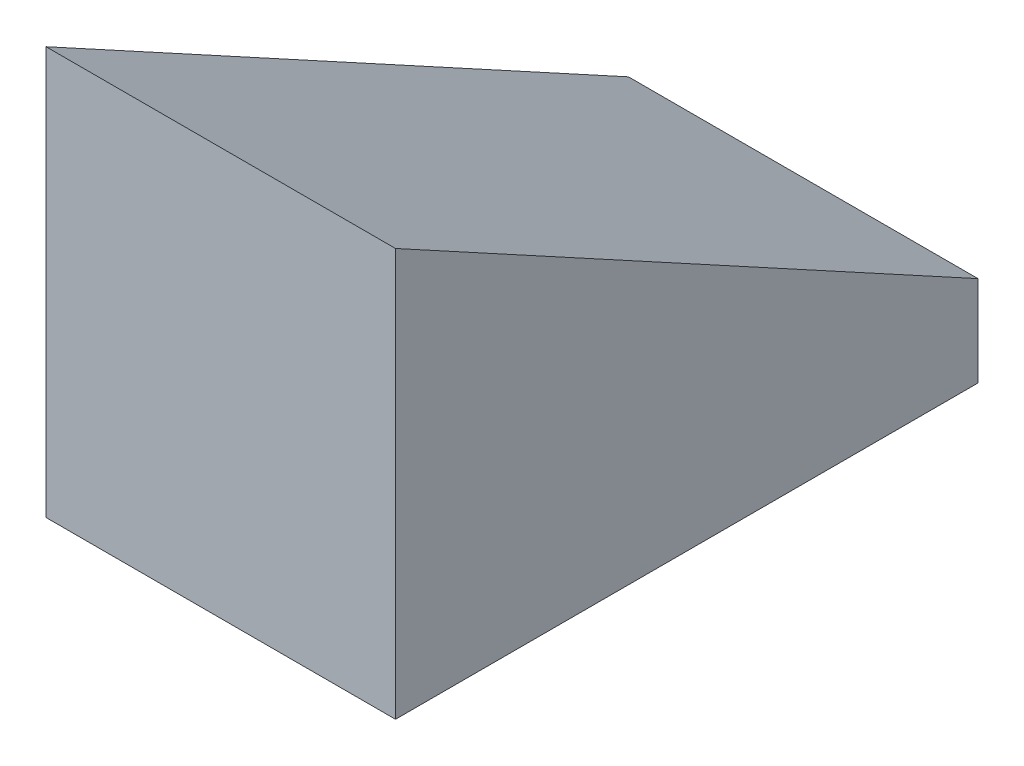
ISO-10303-21;
HEADER;
FILE_DESCRIPTION(('STEP AP214'),'2;1');
FILE_NAME('part.step','',(''),(''),'','','');
FILE_SCHEMA(('AUTOMOTIVE_DESIGN { 1 0 10303 214 1 1 1 1 }'));
ENDSEC;
DATA;
#1=APPLICATION_CONTEXT('core data for automotive mechanical design processes');
#2=APPLICATION_PROTOCOL_DEFINITION('international standard','automotive_design',2000,#1);
#3=PRODUCT_CONTEXT('',#1,'mechanical');
#4=PRODUCT('Part','Part','',(#3));
#5=PRODUCT_RELATED_PRODUCT_CATEGORY('part','',(#4));
#6=PRODUCT_DEFINITION_FORMATION('','',#4);
#7=PRODUCT_DEFINITION_CONTEXT('part definition',#1,'design');
#8=PRODUCT_DEFINITION('design','',#6,#7);
#9=PRODUCT_DEFINITION_SHAPE('','',#8);
#10=(LENGTH_UNIT() NAMED_UNIT(*) SI_UNIT(.MILLI.,.METRE.));
#11=(NAMED_UNIT(*) PLANE_ANGLE_UNIT() SI_UNIT($,.RADIAN.));
#12=(NAMED_UNIT(*) SI_UNIT($,.STERADIAN.) SOLID_ANGLE_UNIT());
#13=UNCERTAINTY_MEASURE_WITH_UNIT(LENGTH_MEASURE(1.E-05),#10,'distance_accuracy_value','');
#14=(GEOMETRIC_REPRESENTATION_CONTEXT(3) GLOBAL_UNCERTAINTY_ASSIGNED_CONTEXT((#13)) GLOBAL_UNIT_ASSIGNED_CONTEXT((#10,
#11,#12)) REPRESENTATION_CONTEXT('',''));
#15=CARTESIAN_POINT('',(0.,0.,0.));
#16=DIRECTION('',(0.,0.,1.));
#17=DIRECTION('',(1.,0.,0.));
#18=AXIS2_PLACEMENT_3D('',#15,#16,#17);
#19=CARTESIAN_POINT('',(60.,0.,-100.));
#20=DIRECTION('',(0.,1.,0.));
#21=DIRECTION('',(0.,0.,1.));
#22=AXIS2_PLACEMENT_3D('',#19,#20,#21);
#23=PLANE('',#22);
#24=DIRECTION('',(0.,0.,-1.));
#25=VECTOR('',#24,1.);
#26=CARTESIAN_POINT('',(0.,0.,-100.));
#27=LINE('',#26,#25);
#28=CARTESIAN_POINT('',(0.,0.,0.));
#29=VERTEX_POINT('',#28);
#30=CARTESIAN_POINT('',(0.,0.,-100.));
#31=VERTEX_POINT('',#30);
#32=EDGE_CURVE('E98',#29,#31,#27,.T.);
#33=ORIENTED_EDGE('',*,*,#32,.T.);
#34=DIRECTION('',(-1.,0.,0.));
#35=VECTOR('',#34,1.);
#36=CARTESIAN_POINT('',(60.,0.,-100.));
#37=LINE('',#36,#35);
#38=CARTESIAN_POINT('',(60.,0.,-100.));
#39=VERTEX_POINT('',#38);
#40=EDGE_CURVE('E11',#39,#31,#37,.T.);
#41=ORIENTED_EDGE('',*,*,#40,.F.);
#42=DIRECTION('',(0.,0.,-1.));
#43=VECTOR('',#42,1.);
#44=CARTESIAN_POINT('',(60.,0.,-100.));
#45=LINE('',#44,#43);
#46=CARTESIAN_POINT('',(60.,0.,0.));
#47=VERTEX_POINT('',#46);
#48=EDGE_CURVE('E86',#47,#39,#45,.T.);
#49=ORIENTED_EDGE('',*,*,#48,.F.);
#50=DIRECTION('',(-1.,0.,0.));
#51=VECTOR('',#50,1.);
#52=CARTESIAN_POINT('',(60.,0.,0.));
#53=LINE('',#52,#51);
#54=EDGE_CURVE('E94',#47,#29,#53,.T.);
#55=ORIENTED_EDGE('',*,*,#54,.T.);
#56=EDGE_LOOP('',(#33,#41,#49,#55));
#57=FACE_BOUND('',#56,.T.);
#58=ADVANCED_FACE('F35',(#57),#23,.F.);
#59=CARTESIAN_POINT('',(60.,15.5193220850039,-100.));
#60=DIRECTION('',(0.,0.,1.));
#61=DIRECTION('',(1.,0.,0.));
#62=AXIS2_PLACEMENT_3D('',#59,#60,#61);
#63=PLANE('',#62);
#64=DIRECTION('',(0.,1.,0.));
#65=VECTOR('',#64,1.);
#66=CARTESIAN_POINT('',(0.,15.5193220850039,-100.));
#67=LINE('',#66,#65);
#68=CARTESIAN_POINT('',(0.,15.5193220850039,-100.));
#69=VERTEX_POINT('',#68);
#70=EDGE_CURVE('E90',#31,#69,#67,.T.);
#71=ORIENTED_EDGE('',*,*,#70,.T.);
#72=DIRECTION('',(-1.,0.,0.));
#73=VECTOR('',#72,1.);
#74=CARTESIAN_POINT('',(60.,15.5193220850039,-100.));
#75=LINE('',#74,#73);
#76=CARTESIAN_POINT('',(60.,15.5193220850039,-100.));
#77=VERTEX_POINT('',#76);
#78=EDGE_CURVE('E43',#77,#69,#75,.T.);
#79=ORIENTED_EDGE('',*,*,#78,.F.);
#80=DIRECTION('',(0.,1.,0.));
#81=VECTOR('',#80,1.);
#82=CARTESIAN_POINT('',(60.,15.5193220850039,-100.));
#83=LINE('',#82,#81);
#84=EDGE_CURVE('E81',#39,#77,#83,.T.);
#85=ORIENTED_EDGE('',*,*,#84,.F.);
#86=ORIENTED_EDGE('',*,*,#40,.T.);
#87=EDGE_LOOP('',(#71,#79,#85,#86));
#88=FACE_BOUND('',#87,.T.);
#89=ADVANCED_FACE('F89',(#88),#63,.F.);
#90=CARTESIAN_POINT('',(60.,70.,0.));
#91=DIRECTION('',(0.,-0.878134587758275,0.478413676416765));
#92=DIRECTION('',(0.,-0.478413676416765,-0.878134587758275));
#93=AXIS2_PLACEMENT_3D('',#90,#91,#92);
#94=PLANE('',#93);
#95=DIRECTION('',(0.,0.478413676416765,0.878134587758275));
#96=VECTOR('',#95,1.);
#97=CARTESIAN_POINT('',(0.,70.,0.));
#98=LINE('',#97,#96);
#99=CARTESIAN_POINT('',(0.,70.,0.));
#100=VERTEX_POINT('',#99);
#101=EDGE_CURVE('E68',#69,#100,#98,.T.);
#102=ORIENTED_EDGE('',*,*,#101,.T.);
#103=DIRECTION('',(-1.,0.,0.));
#104=VECTOR('',#103,1.);
#105=CARTESIAN_POINT('',(60.,70.,0.));
#106=LINE('',#105,#104);
#107=CARTESIAN_POINT('',(60.,70.,0.));
#108=VERTEX_POINT('',#107);
#109=EDGE_CURVE('E91',#108,#100,#106,.T.);
#110=ORIENTED_EDGE('',*,*,#109,.F.);
#111=DIRECTION('',(0.,0.478413676416765,0.878134587758275));
#112=VECTOR('',#111,1.);
#113=CARTESIAN_POINT('',(60.,70.,0.));
#114=LINE('',#113,#112);
#115=EDGE_CURVE('E84',#77,#108,#114,.T.);
#116=ORIENTED_EDGE('',*,*,#115,.F.);
#117=ORIENTED_EDGE('',*,*,#78,.T.);
#118=EDGE_LOOP('',(#102,#110,#116,#117));
#119=FACE_BOUND('',#118,.T.);
#120=ADVANCED_FACE('F92',(#119),#94,.F.);
#121=CARTESIAN_POINT('',(60.,0.,0.));
#122=DIRECTION('',(0.,0.,-1.));
#123=DIRECTION('',(-1.,0.,0.));
#124=AXIS2_PLACEMENT_3D('',#121,#122,#123);
#125=PLANE('',#124);
#126=DIRECTION('',(0.,-1.,0.));
#127=VECTOR('',#126,1.);
#128=CARTESIAN_POINT('',(0.,0.,0.));
#129=LINE('',#128,#127);
#130=EDGE_CURVE('E74',#100,#29,#129,.T.);
#131=ORIENTED_EDGE('',*,*,#130,.T.);
#132=ORIENTED_EDGE('',*,*,#54,.F.);
#133=DIRECTION('',(0.,-1.,0.));
#134=VECTOR('',#133,1.);
#135=CARTESIAN_POINT('',(60.,0.,0.));
#136=LINE('',#135,#134);
#137=EDGE_CURVE('E51',#108,#47,#136,.T.);
#138=ORIENTED_EDGE('',*,*,#137,.F.);
#139=ORIENTED_EDGE('',*,*,#109,.T.);
#140=EDGE_LOOP('',(#131,#132,#138,#139));
#141=FACE_BOUND('',#140,.T.);
#142=ADVANCED_FACE('F105',(#141),#125,.F.);
#143=CARTESIAN_POINT('',(60.,0.,0.));
#144=DIRECTION('',(-1.,0.,0.));
#145=DIRECTION('',(0.,0.,1.));
#146=AXIS2_PLACEMENT_3D('',#143,#144,#145);
#147=PLANE('',#146);
#148=ORIENTED_EDGE('',*,*,#48,.T.);
#149=ORIENTED_EDGE('',*,*,#84,.T.);
#150=ORIENTED_EDGE('',*,*,#115,.T.);
#151=ORIENTED_EDGE('',*,*,#137,.T.);
#152=EDGE_LOOP('',(#148,#149,#150,#151));
#153=FACE_BOUND('',#152,.T.);
#154=ADVANCED_FACE('F82',(#153),#147,.F.);
#155=CARTESIAN_POINT('',(0.,0.,0.));
#156=DIRECTION('',(-1.,0.,0.));
#157=DIRECTION('',(0.,0.,1.));
#158=AXIS2_PLACEMENT_3D('',#155,#156,#157);
#159=PLANE('',#158);
#160=ORIENTED_EDGE('',*,*,#32,.F.);
#161=ORIENTED_EDGE('',*,*,#130,.F.);
#162=ORIENTED_EDGE('',*,*,#101,.F.);
#163=ORIENTED_EDGE('',*,*,#70,.F.);
#164=EDGE_LOOP('',(#160,#161,#162,#163));
#165=FACE_BOUND('',#164,.T.);
#166=ADVANCED_FACE('F108',(#165),#159,.T.);
#167=CLOSED_SHELL('',(#58,#89,#120,#142,#154,#166));
#168=MANIFOLD_SOLID_BREP('B2',#167);
#169=ADVANCED_BREP_SHAPE_REPRESENTATION('',(#18,#168),#14);
#170=SHAPE_DEFINITION_REPRESENTATION(#9,#169);
ENDSEC;
END-ISO-10303-21;
